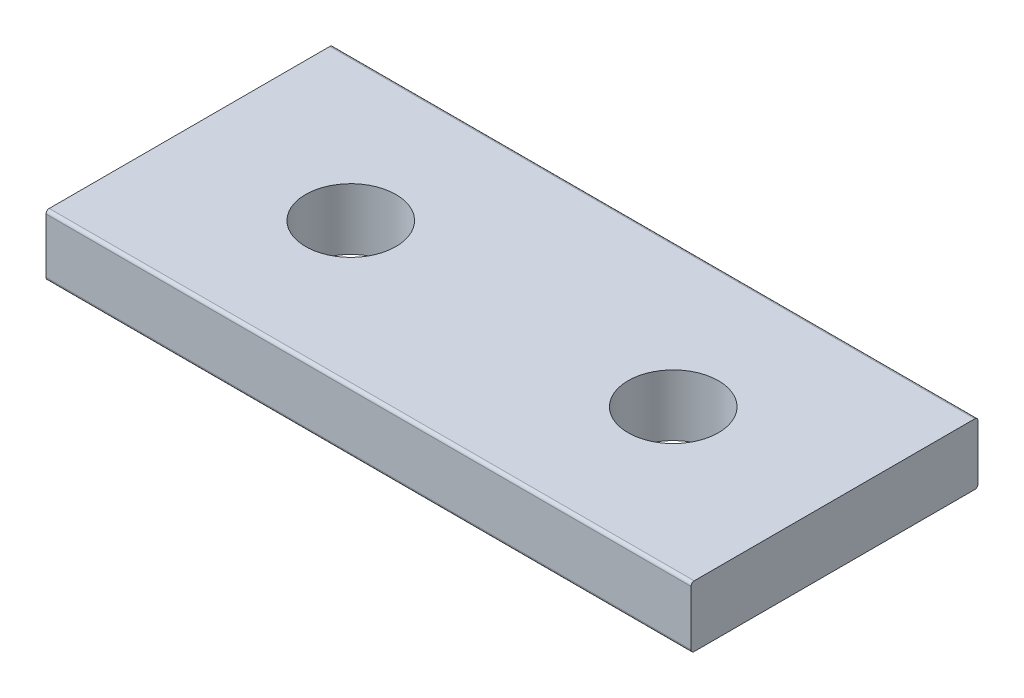
ISO-10303-21;
HEADER;
FILE_DESCRIPTION(('STEP AP214'),'2;1');
FILE_NAME('part.step','',(''),(''),'','','');
FILE_SCHEMA(('AUTOMOTIVE_DESIGN { 1 0 10303 214 1 1 1 1 }'));
ENDSEC;
DATA;
#1=APPLICATION_CONTEXT('core data for automotive mechanical design processes');
#2=APPLICATION_PROTOCOL_DEFINITION('international standard','automotive_design',2000,#1);
#3=PRODUCT_CONTEXT('',#1,'mechanical');
#4=PRODUCT('Part','Part','',(#3));
#5=PRODUCT_RELATED_PRODUCT_CATEGORY('part','',(#4));
#6=PRODUCT_DEFINITION_FORMATION('','',#4);
#7=PRODUCT_DEFINITION_CONTEXT('part definition',#1,'design');
#8=PRODUCT_DEFINITION('design','',#6,#7);
#9=PRODUCT_DEFINITION_SHAPE('','',#8);
#10=(LENGTH_UNIT() NAMED_UNIT(*) SI_UNIT(.MILLI.,.METRE.));
#11=(NAMED_UNIT(*) PLANE_ANGLE_UNIT() SI_UNIT($,.RADIAN.));
#12=(NAMED_UNIT(*) SI_UNIT($,.STERADIAN.) SOLID_ANGLE_UNIT());
#13=UNCERTAINTY_MEASURE_WITH_UNIT(LENGTH_MEASURE(1.E-05),#10,'distance_accuracy_value','');
#14=(GEOMETRIC_REPRESENTATION_CONTEXT(3) GLOBAL_UNCERTAINTY_ASSIGNED_CONTEXT((#13)) GLOBAL_UNIT_ASSIGNED_CONTEXT((#10,
#11,#12)) REPRESENTATION_CONTEXT('',''));
#15=CARTESIAN_POINT('',(0.,0.,0.));
#16=DIRECTION('',(0.,0.,1.));
#17=DIRECTION('',(1.,0.,0.));
#18=AXIS2_PLACEMENT_3D('',#15,#16,#17);
#19=CARTESIAN_POINT('',(-20.,-1.9,8.9));
#20=DIRECTION('',(0.,0.,1.));
#21=DIRECTION('',(1.,0.,0.));
#22=AXIS2_PLACEMENT_3D('',#19,#20,#21);
#23=PLANE('',#22);
#24=DIRECTION('',(0.,1.,0.));
#25=VECTOR('',#24,1.);
#26=CARTESIAN_POINT('',(-20.,-1.9,8.9));
#27=LINE('',#26,#25);
#28=CARTESIAN_POINT('',(-20.,-1.7,8.9));
#29=VERTEX_POINT('',#28);
#30=CARTESIAN_POINT('',(-20.,1.7,8.9));
#31=VERTEX_POINT('',#30);
#32=EDGE_CURVE('E106',#29,#31,#27,.T.);
#33=ORIENTED_EDGE('',*,*,#32,.F.);
#34=DIRECTION('',(1.,0.,0.));
#35=VECTOR('',#34,1.);
#36=CARTESIAN_POINT('',(20.,-1.7,8.9));
#37=LINE('',#36,#35);
#38=CARTESIAN_POINT('',(20.,-1.7,8.9));
#39=VERTEX_POINT('',#38);
#40=EDGE_CURVE('E119',#29,#39,#37,.T.);
#41=ORIENTED_EDGE('',*,*,#40,.T.);
#42=DIRECTION('',(0.,1.,0.));
#43=VECTOR('',#42,1.);
#44=CARTESIAN_POINT('',(20.,-1.9,8.9));
#45=LINE('',#44,#43);
#46=CARTESIAN_POINT('',(20.,1.7,8.9));
#47=VERTEX_POINT('',#46);
#48=EDGE_CURVE('E163',#39,#47,#45,.T.);
#49=ORIENTED_EDGE('',*,*,#48,.T.);
#50=DIRECTION('',(1.,0.,0.));
#51=VECTOR('',#50,1.);
#52=CARTESIAN_POINT('',(-20.,1.7,8.9));
#53=LINE('',#52,#51);
#54=EDGE_CURVE('E122',#47,#31,#53,.F.);
#55=ORIENTED_EDGE('',*,*,#54,.T.);
#56=EDGE_LOOP('',(#33,#41,#49,#55));
#57=FACE_BOUND('',#56,.T.);
#58=ADVANCED_FACE('F37',(#57),#23,.T.);
#59=CARTESIAN_POINT('',(-20.,-1.9,-8.9));
#60=DIRECTION('',(-1.,0.,0.));
#61=DIRECTION('',(0.,0.,1.));
#62=AXIS2_PLACEMENT_3D('',#59,#60,#61);
#63=PLANE('',#62);
#64=DIRECTION('',(0.,0.,1.));
#65=VECTOR('',#64,1.);
#66=CARTESIAN_POINT('',(-20.,-1.9,-8.9));
#67=LINE('',#66,#65);
#68=CARTESIAN_POINT('',(-20.,-1.9,-8.7));
#69=VERTEX_POINT('',#68);
#70=CARTESIAN_POINT('',(-20.,-1.9,8.7));
#71=VERTEX_POINT('',#70);
#72=EDGE_CURVE('E109',#69,#71,#67,.T.);
#73=ORIENTED_EDGE('',*,*,#72,.T.);
#74=CARTESIAN_POINT('',(-20.,-1.7,8.7));
#75=DIRECTION('',(-1.,0.,0.));
#76=DIRECTION('',(0.,0.,1.));
#77=AXIS2_PLACEMENT_3D('',#74,#75,#76);
#78=CIRCLE('',#77,0.2);
#79=EDGE_CURVE('E103',#71,#29,#78,.T.);
#80=ORIENTED_EDGE('',*,*,#79,.T.);
#81=ORIENTED_EDGE('',*,*,#32,.T.);
#82=CARTESIAN_POINT('',(-20.,1.7,8.7));
#83=DIRECTION('',(-1.,0.,0.));
#84=DIRECTION('',(0.,0.,1.));
#85=AXIS2_PLACEMENT_3D('',#82,#83,#84);
#86=CIRCLE('',#85,0.2);
#87=CARTESIAN_POINT('',(-20.,1.9,8.7));
#88=VERTEX_POINT('',#87);
#89=EDGE_CURVE('E114',#31,#88,#86,.T.);
#90=ORIENTED_EDGE('',*,*,#89,.T.);
#91=DIRECTION('',(0.,0.,1.));
#92=VECTOR('',#91,1.);
#93=CARTESIAN_POINT('',(-20.,1.9,-8.9));
#94=LINE('',#93,#92);
#95=CARTESIAN_POINT('',(-20.,1.9,-8.7));
#96=VERTEX_POINT('',#95);
#97=EDGE_CURVE('E169',#96,#88,#94,.T.);
#98=ORIENTED_EDGE('',*,*,#97,.F.);
#99=CARTESIAN_POINT('',(-20.,1.7,-8.7));
#100=DIRECTION('',(-1.,0.,0.));
#101=DIRECTION('',(0.,0.,1.));
#102=AXIS2_PLACEMENT_3D('',#99,#100,#101);
#103=CIRCLE('',#102,0.2);
#104=CARTESIAN_POINT('',(-20.,1.7,-8.9));
#105=VERTEX_POINT('',#104);
#106=EDGE_CURVE('E52',#96,#105,#103,.T.);
#107=ORIENTED_EDGE('',*,*,#106,.T.);
#108=DIRECTION('',(0.,1.,0.));
#109=VECTOR('',#108,1.);
#110=CARTESIAN_POINT('',(-20.,-1.9,-8.9));
#111=LINE('',#110,#109);
#112=CARTESIAN_POINT('',(-20.,-1.7,-8.9));
#113=VERTEX_POINT('',#112);
#114=EDGE_CURVE('E123',#113,#105,#111,.T.);
#115=ORIENTED_EDGE('',*,*,#114,.F.);
#116=CARTESIAN_POINT('',(-20.,-1.7,-8.7));
#117=DIRECTION('',(-1.,0.,0.));
#118=DIRECTION('',(0.,0.,1.));
#119=AXIS2_PLACEMENT_3D('',#116,#117,#118);
#120=CIRCLE('',#119,0.2);
#121=EDGE_CURVE('E60',#113,#69,#120,.T.);
#122=ORIENTED_EDGE('',*,*,#121,.T.);
#123=EDGE_LOOP('',(#73,#80,#81,#90,#98,#107,#115,#122));
#124=FACE_BOUND('',#123,.T.);
#125=ADVANCED_FACE('F105',(#124),#63,.T.);
#126=CARTESIAN_POINT('',(20.,-1.9,-8.9));
#127=DIRECTION('',(0.,0.,-1.));
#128=DIRECTION('',(-1.,0.,0.));
#129=AXIS2_PLACEMENT_3D('',#126,#127,#128);
#130=PLANE('',#129);
#131=DIRECTION('',(0.,1.,0.));
#132=VECTOR('',#131,1.);
#133=CARTESIAN_POINT('',(20.,-1.9,-8.9));
#134=LINE('',#133,#132);
#135=CARTESIAN_POINT('',(20.,-1.7,-8.9));
#136=VERTEX_POINT('',#135);
#137=CARTESIAN_POINT('',(20.,1.7,-8.9));
#138=VERTEX_POINT('',#137);
#139=EDGE_CURVE('E154',#136,#138,#134,.T.);
#140=ORIENTED_EDGE('',*,*,#139,.F.);
#141=DIRECTION('',(-1.,0.,0.));
#142=VECTOR('',#141,1.);
#143=CARTESIAN_POINT('',(-20.,-1.7,-8.9));
#144=LINE('',#143,#142);
#145=EDGE_CURVE('E11',#136,#113,#144,.T.);
#146=ORIENTED_EDGE('',*,*,#145,.T.);
#147=ORIENTED_EDGE('',*,*,#114,.T.);
#148=DIRECTION('',(-1.,0.,0.));
#149=VECTOR('',#148,1.);
#150=CARTESIAN_POINT('',(20.,1.7,-8.9));
#151=LINE('',#150,#149);
#152=EDGE_CURVE('E45',#105,#138,#151,.F.);
#153=ORIENTED_EDGE('',*,*,#152,.T.);
#154=EDGE_LOOP('',(#140,#146,#147,#153));
#155=FACE_BOUND('',#154,.T.);
#156=ADVANCED_FACE('F153',(#155),#130,.T.);
#157=CARTESIAN_POINT('',(20.,-1.9,8.9));
#158=DIRECTION('',(1.,0.,0.));
#159=DIRECTION('',(0.,0.,-1.));
#160=AXIS2_PLACEMENT_3D('',#157,#158,#159);
#161=PLANE('',#160);
#162=ORIENTED_EDGE('',*,*,#48,.F.);
#163=CARTESIAN_POINT('',(20.,-1.7,8.7));
#164=DIRECTION('',(1.,0.,0.));
#165=DIRECTION('',(0.,0.,-1.));
#166=AXIS2_PLACEMENT_3D('',#163,#164,#165);
#167=CIRCLE('',#166,0.2);
#168=CARTESIAN_POINT('',(20.,-1.9,8.7));
#169=VERTEX_POINT('',#168);
#170=EDGE_CURVE('E126',#39,#169,#167,.T.);
#171=ORIENTED_EDGE('',*,*,#170,.T.);
#172=DIRECTION('',(0.,0.,-1.));
#173=VECTOR('',#172,1.);
#174=CARTESIAN_POINT('',(20.,-1.9,8.9));
#175=LINE('',#174,#173);
#176=CARTESIAN_POINT('',(20.,-1.9,-8.7));
#177=VERTEX_POINT('',#176);
#178=EDGE_CURVE('E172',#169,#177,#175,.T.);
#179=ORIENTED_EDGE('',*,*,#178,.T.);
#180=CARTESIAN_POINT('',(20.,-1.7,-8.7));
#181=DIRECTION('',(1.,0.,0.));
#182=DIRECTION('',(0.,0.,-1.));
#183=AXIS2_PLACEMENT_3D('',#180,#181,#182);
#184=CIRCLE('',#183,0.2);
#185=EDGE_CURVE('E129',#177,#136,#184,.T.);
#186=ORIENTED_EDGE('',*,*,#185,.T.);
#187=ORIENTED_EDGE('',*,*,#139,.T.);
#188=CARTESIAN_POINT('',(20.,1.7,-8.7));
#189=DIRECTION('',(1.,0.,0.));
#190=DIRECTION('',(0.,0.,-1.));
#191=AXIS2_PLACEMENT_3D('',#188,#189,#190);
#192=CIRCLE('',#191,0.2);
#193=CARTESIAN_POINT('',(20.,1.9,-8.7));
#194=VERTEX_POINT('',#193);
#195=EDGE_CURVE('E127',#138,#194,#192,.T.);
#196=ORIENTED_EDGE('',*,*,#195,.T.);
#197=DIRECTION('',(0.,0.,-1.));
#198=VECTOR('',#197,1.);
#199=CARTESIAN_POINT('',(20.,1.9,8.9));
#200=LINE('',#199,#198);
#201=CARTESIAN_POINT('',(20.,1.9,8.7));
#202=VERTEX_POINT('',#201);
#203=EDGE_CURVE('E171',#202,#194,#200,.T.);
#204=ORIENTED_EDGE('',*,*,#203,.F.);
#205=CARTESIAN_POINT('',(20.,1.7,8.7));
#206=DIRECTION('',(1.,0.,0.));
#207=DIRECTION('',(0.,0.,-1.));
#208=AXIS2_PLACEMENT_3D('',#205,#206,#207);
#209=CIRCLE('',#208,0.2);
#210=EDGE_CURVE('E135',#202,#47,#209,.T.);
#211=ORIENTED_EDGE('',*,*,#210,.T.);
#212=EDGE_LOOP('',(#162,#171,#179,#186,#187,#196,#204,#211));
#213=FACE_BOUND('',#212,.T.);
#214=ADVANCED_FACE('F158',(#213),#161,.T.);
#215=CARTESIAN_POINT('',(0.,-1.9,0.));
#216=DIRECTION('',(0.,1.,0.));
#217=DIRECTION('',(0.,0.,1.));
#218=AXIS2_PLACEMENT_3D('',#215,#216,#217);
#219=PLANE('',#218);
#220=CARTESIAN_POINT('',(-10.,-1.9,0.));
#221=DIRECTION('',(0.,-1.,0.));
#222=DIRECTION('',(0.,0.,-1.));
#223=AXIS2_PLACEMENT_3D('',#220,#221,#222);
#224=CIRCLE('',#223,2.79999999999999);
#225=CARTESIAN_POINT('',(-10.,-1.9,-2.79999999999999));
#226=VERTEX_POINT('',#225);
#227=EDGE_CURVE('E188',#226,#226,#224,.T.);
#228=ORIENTED_EDGE('',*,*,#227,.F.);
#229=EDGE_LOOP('',(#228));
#230=FACE_BOUND('',#229,.T.);
#231=CARTESIAN_POINT('',(10.,-1.9,0.));
#232=DIRECTION('',(0.,-1.,0.));
#233=DIRECTION('',(0.,0.,-1.));
#234=AXIS2_PLACEMENT_3D('',#231,#232,#233);
#235=CIRCLE('',#234,2.79999999999999);
#236=CARTESIAN_POINT('',(10.,-1.9,-2.79999999999999));
#237=VERTEX_POINT('',#236);
#238=EDGE_CURVE('E182',#237,#237,#235,.T.);
#239=ORIENTED_EDGE('',*,*,#238,.F.);
#240=EDGE_LOOP('',(#239));
#241=FACE_BOUND('',#240,.T.);
#242=ORIENTED_EDGE('',*,*,#178,.F.);
#243=DIRECTION('',(1.,0.,0.));
#244=VECTOR('',#243,1.);
#245=CARTESIAN_POINT('',(-20.,-1.9,8.7));
#246=LINE('',#245,#244);
#247=EDGE_CURVE('E140',#169,#71,#246,.F.);
#248=ORIENTED_EDGE('',*,*,#247,.T.);
#249=ORIENTED_EDGE('',*,*,#72,.F.);
#250=DIRECTION('',(-1.,0.,0.));
#251=VECTOR('',#250,1.);
#252=CARTESIAN_POINT('',(20.,-1.9,-8.7));
#253=LINE('',#252,#251);
#254=EDGE_CURVE('E138',#69,#177,#253,.F.);
#255=ORIENTED_EDGE('',*,*,#254,.T.);
#256=EDGE_LOOP('',(#242,#248,#249,#255));
#257=FACE_BOUND('',#256,.T.);
#258=ADVANCED_FACE('F194',(#230,#241,#257),#219,.F.);
#259=CARTESIAN_POINT('',(0.,1.9,0.));
#260=DIRECTION('',(0.,1.,0.));
#261=DIRECTION('',(0.,0.,1.));
#262=AXIS2_PLACEMENT_3D('',#259,#260,#261);
#263=PLANE('',#262);
#264=CARTESIAN_POINT('',(-10.,1.9,0.));
#265=DIRECTION('',(0.,-1.,0.));
#266=DIRECTION('',(0.,0.,-1.));
#267=AXIS2_PLACEMENT_3D('',#264,#265,#266);
#268=CIRCLE('',#267,2.79999999999999);
#269=CARTESIAN_POINT('',(-10.,1.9,-2.79999999999999));
#270=VERTEX_POINT('',#269);
#271=EDGE_CURVE('E185',#270,#270,#268,.T.);
#272=ORIENTED_EDGE('',*,*,#271,.T.);
#273=EDGE_LOOP('',(#272));
#274=FACE_BOUND('',#273,.T.);
#275=CARTESIAN_POINT('',(10.,1.9,0.));
#276=DIRECTION('',(0.,-1.,0.));
#277=DIRECTION('',(0.,0.,-1.));
#278=AXIS2_PLACEMENT_3D('',#275,#276,#277);
#279=CIRCLE('',#278,2.79999999999999);
#280=CARTESIAN_POINT('',(10.,1.9,-2.79999999999999));
#281=VERTEX_POINT('',#280);
#282=EDGE_CURVE('E175',#281,#281,#279,.T.);
#283=ORIENTED_EDGE('',*,*,#282,.T.);
#284=EDGE_LOOP('',(#283));
#285=FACE_BOUND('',#284,.T.);
#286=ORIENTED_EDGE('',*,*,#97,.T.);
#287=DIRECTION('',(1.,0.,0.));
#288=VECTOR('',#287,1.);
#289=CARTESIAN_POINT('',(0.,1.9,8.7));
#290=LINE('',#289,#288);
#291=EDGE_CURVE('E147',#88,#202,#290,.T.);
#292=ORIENTED_EDGE('',*,*,#291,.T.);
#293=ORIENTED_EDGE('',*,*,#203,.T.);
#294=DIRECTION('',(-1.,0.,0.));
#295=VECTOR('',#294,1.);
#296=CARTESIAN_POINT('',(0.,1.9,-8.7));
#297=LINE('',#296,#295);
#298=EDGE_CURVE('E113',#194,#96,#297,.T.);
#299=ORIENTED_EDGE('',*,*,#298,.T.);
#300=EDGE_LOOP('',(#286,#292,#293,#299));
#301=FACE_BOUND('',#300,.T.);
#302=ADVANCED_FACE('F168',(#274,#285,#301),#263,.T.);
#303=CARTESIAN_POINT('',(10.,-1.9,0.));
#304=DIRECTION('',(0.,-1.,0.));
#305=DIRECTION('',(0.,0.,-1.));
#306=AXIS2_PLACEMENT_3D('',#303,#304,#305);
#307=CYLINDRICAL_SURFACE('',#306,2.79999999999999);
#308=ORIENTED_EDGE('',*,*,#282,.F.);
#309=EDGE_LOOP('',(#308));
#310=FACE_BOUND('',#309,.T.);
#311=ORIENTED_EDGE('',*,*,#238,.T.);
#312=EDGE_LOOP('',(#311));
#313=FACE_BOUND('',#312,.T.);
#314=ADVANCED_FACE('F223',(#310,#313),#307,.F.);
#315=CARTESIAN_POINT('',(-10.,-1.9,0.));
#316=DIRECTION('',(0.,-1.,0.));
#317=DIRECTION('',(0.,0.,-1.));
#318=AXIS2_PLACEMENT_3D('',#315,#316,#317);
#319=CYLINDRICAL_SURFACE('',#318,2.79999999999999);
#320=ORIENTED_EDGE('',*,*,#271,.F.);
#321=EDGE_LOOP('',(#320));
#322=FACE_BOUND('',#321,.T.);
#323=ORIENTED_EDGE('',*,*,#227,.T.);
#324=EDGE_LOOP('',(#323));
#325=FACE_BOUND('',#324,.T.);
#326=ADVANCED_FACE('F192',(#322,#325),#319,.F.);
#327=CARTESIAN_POINT('',(-20.,-1.7,8.7));
#328=DIRECTION('',(-1.,0.,0.));
#329=DIRECTION('',(0.,0.,1.));
#330=AXIS2_PLACEMENT_3D('',#327,#328,#329);
#331=CYLINDRICAL_SURFACE('',#330,0.2);
#332=ORIENTED_EDGE('',*,*,#79,.F.);
#333=ORIENTED_EDGE('',*,*,#247,.F.);
#334=ORIENTED_EDGE('',*,*,#170,.F.);
#335=ORIENTED_EDGE('',*,*,#40,.F.);
#336=EDGE_LOOP('',(#332,#333,#334,#335));
#337=FACE_BOUND('',#336,.T.);
#338=ADVANCED_FACE('F125',(#337),#331,.T.);
#339=CARTESIAN_POINT('',(0.,1.7,8.7));
#340=DIRECTION('',(1.,0.,0.));
#341=DIRECTION('',(0.,0.,-1.));
#342=AXIS2_PLACEMENT_3D('',#339,#340,#341);
#343=CYLINDRICAL_SURFACE('',#342,0.2);
#344=ORIENTED_EDGE('',*,*,#89,.F.);
#345=ORIENTED_EDGE('',*,*,#54,.F.);
#346=ORIENTED_EDGE('',*,*,#210,.F.);
#347=ORIENTED_EDGE('',*,*,#291,.F.);
#348=EDGE_LOOP('',(#344,#345,#346,#347));
#349=FACE_BOUND('',#348,.T.);
#350=ADVANCED_FACE('F203',(#349),#343,.T.);
#351=CARTESIAN_POINT('',(20.,-1.7,-8.7));
#352=DIRECTION('',(1.,0.,0.));
#353=DIRECTION('',(0.,0.,-1.));
#354=AXIS2_PLACEMENT_3D('',#351,#352,#353);
#355=CYLINDRICAL_SURFACE('',#354,0.2);
#356=ORIENTED_EDGE('',*,*,#185,.F.);
#357=ORIENTED_EDGE('',*,*,#254,.F.);
#358=ORIENTED_EDGE('',*,*,#121,.F.);
#359=ORIENTED_EDGE('',*,*,#145,.F.);
#360=EDGE_LOOP('',(#356,#357,#358,#359));
#361=FACE_BOUND('',#360,.T.);
#362=ADVANCED_FACE('F201',(#361),#355,.T.);
#363=CARTESIAN_POINT('',(0.,1.7,-8.7));
#364=DIRECTION('',(-1.,0.,0.));
#365=DIRECTION('',(0.,0.,1.));
#366=AXIS2_PLACEMENT_3D('',#363,#364,#365);
#367=CYLINDRICAL_SURFACE('',#366,0.2);
#368=ORIENTED_EDGE('',*,*,#195,.F.);
#369=ORIENTED_EDGE('',*,*,#152,.F.);
#370=ORIENTED_EDGE('',*,*,#106,.F.);
#371=ORIENTED_EDGE('',*,*,#298,.F.);
#372=EDGE_LOOP('',(#368,#369,#370,#371));
#373=FACE_BOUND('',#372,.T.);
#374=ADVANCED_FACE('F39',(#373),#367,.T.);
#375=CLOSED_SHELL('',(#58,#125,#156,#214,#258,#302,#314,#326,#338,#350,#362,#374));
#376=MANIFOLD_SOLID_BREP('B2',#375);
#377=ADVANCED_BREP_SHAPE_REPRESENTATION('',(#18,#376),#14);
#378=SHAPE_DEFINITION_REPRESENTATION(#9,#377);
ENDSEC;
END-ISO-10303-21;
